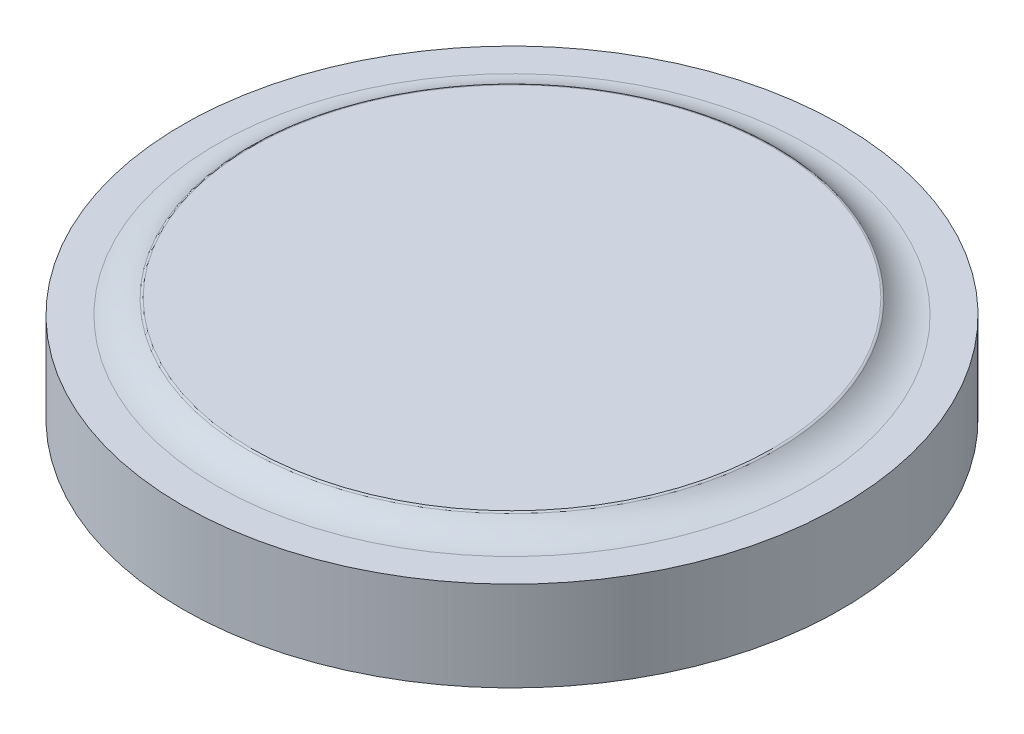
ISO-10303-21;
HEADER;
FILE_DESCRIPTION(('STEP AP214'),'2;1');
FILE_NAME('part.step','',(''),(''),'','','');
FILE_SCHEMA(('AUTOMOTIVE_DESIGN { 1 0 10303 214 1 1 1 1 }'));
ENDSEC;
DATA;
#1=APPLICATION_CONTEXT('core data for automotive mechanical design processes');
#2=APPLICATION_PROTOCOL_DEFINITION('international standard','automotive_design',2000,#1);
#3=PRODUCT_CONTEXT('',#1,'mechanical');
#4=PRODUCT('Part','Part','',(#3));
#5=PRODUCT_RELATED_PRODUCT_CATEGORY('part','',(#4));
#6=PRODUCT_DEFINITION_FORMATION('','',#4);
#7=PRODUCT_DEFINITION_CONTEXT('part definition',#1,'design');
#8=PRODUCT_DEFINITION('design','',#6,#7);
#9=PRODUCT_DEFINITION_SHAPE('','',#8);
#10=(LENGTH_UNIT() NAMED_UNIT(*) SI_UNIT(.MILLI.,.METRE.));
#11=(NAMED_UNIT(*) PLANE_ANGLE_UNIT() SI_UNIT($,.RADIAN.));
#12=(NAMED_UNIT(*) SI_UNIT($,.STERADIAN.) SOLID_ANGLE_UNIT());
#13=UNCERTAINTY_MEASURE_WITH_UNIT(LENGTH_MEASURE(1.E-05),#10,'distance_accuracy_value','');
#14=(GEOMETRIC_REPRESENTATION_CONTEXT(3) GLOBAL_UNCERTAINTY_ASSIGNED_CONTEXT((#13)) GLOBAL_UNIT_ASSIGNED_CONTEXT((#10,
#11,#12)) REPRESENTATION_CONTEXT('',''));
#15=CARTESIAN_POINT('',(0.,0.,0.));
#16=DIRECTION('',(0.,0.,1.));
#17=DIRECTION('',(1.,0.,0.));
#18=AXIS2_PLACEMENT_3D('',#15,#16,#17);
#19=CARTESIAN_POINT('',(0.,3.,0.));
#20=DIRECTION('',(0.,-1.,0.));
#21=DIRECTION('',(0.,0.,-1.));
#22=AXIS2_PLACEMENT_3D('',#19,#20,#21);
#23=CYLINDRICAL_SURFACE('',#22,11.);
#24=CARTESIAN_POINT('',(0.,3.,0.));
#25=DIRECTION('',(0.,1.,0.));
#26=DIRECTION('',(0.,0.,1.));
#27=AXIS2_PLACEMENT_3D('',#24,#25,#26);
#28=CIRCLE('',#27,11.);
#29=CARTESIAN_POINT('',(0.,3.,11.));
#30=VERTEX_POINT('',#29);
#31=EDGE_CURVE('E51',#30,#30,#28,.T.);
#32=ORIENTED_EDGE('',*,*,#31,.F.);
#33=EDGE_LOOP('',(#32));
#34=FACE_BOUND('',#33,.T.);
#35=CARTESIAN_POINT('',(0.,0.,0.));
#36=DIRECTION('',(0.,1.,0.));
#37=DIRECTION('',(0.,0.,1.));
#38=AXIS2_PLACEMENT_3D('',#35,#36,#37);
#39=CIRCLE('',#38,11.);
#40=CARTESIAN_POINT('',(0.,0.,11.));
#41=VERTEX_POINT('',#40);
#42=EDGE_CURVE('E54',#41,#41,#39,.T.);
#43=ORIENTED_EDGE('',*,*,#42,.T.);
#44=EDGE_LOOP('',(#43));
#45=FACE_BOUND('',#44,.T.);
#46=ADVANCED_FACE('F36',(#34,#45),#23,.T.);
#47=CARTESIAN_POINT('',(0.,3.,0.));
#48=DIRECTION('',(0.,1.,0.));
#49=DIRECTION('',(0.,0.,1.));
#50=AXIS2_PLACEMENT_3D('',#47,#48,#49);
#51=PLANE('',#50);
#52=CARTESIAN_POINT('',(0.,3.,0.));
#53=DIRECTION('',(0.,1.,0.));
#54=DIRECTION('',(0.,0.,1.));
#55=AXIS2_PLACEMENT_3D('',#52,#53,#54);
#56=CIRCLE('',#55,9.8680339887499);
#57=CARTESIAN_POINT('',(0.,3.,9.8680339887499));
#58=VERTEX_POINT('',#57);
#59=EDGE_CURVE('E47',#58,#58,#56,.F.);
#60=ORIENTED_EDGE('',*,*,#59,.T.);
#61=EDGE_LOOP('',(#60));
#62=FACE_BOUND('',#61,.T.);
#63=ORIENTED_EDGE('',*,*,#31,.T.);
#64=EDGE_LOOP('',(#63));
#65=FACE_BOUND('',#64,.T.);
#66=ADVANCED_FACE('F60',(#62,#65),#51,.T.);
#67=CARTESIAN_POINT('',(0.,0.,0.));
#68=DIRECTION('',(0.,1.,0.));
#69=DIRECTION('',(0.,0.,1.));
#70=AXIS2_PLACEMENT_3D('',#67,#68,#69);
#71=PLANE('',#70);
#72=ORIENTED_EDGE('',*,*,#42,.F.);
#73=EDGE_LOOP('',(#72));
#74=FACE_BOUND('',#73,.T.);
#75=ADVANCED_FACE('F67',(#74),#71,.F.);
#76=CARTESIAN_POINT('',(0.,3.5,0.));
#77=DIRECTION('',(0.,1.,0.));
#78=DIRECTION('',(0.,0.,1.));
#79=AXIS2_PLACEMENT_3D('',#76,#77,#78);
#80=PLANE('',#79);
#81=CARTESIAN_POINT('',(0.,3.5,0.));
#82=DIRECTION('',(0.,1.,0.));
#83=DIRECTION('',(0.,0.,1.));
#84=AXIS2_PLACEMENT_3D('',#81,#82,#83);
#85=CIRCLE('',#84,8.70613898488767);
#86=CARTESIAN_POINT('',(0.,3.5,8.70613898488767));
#87=VERTEX_POINT('',#86);
#88=EDGE_CURVE('E43',#87,#87,#85,.T.);
#89=ORIENTED_EDGE('',*,*,#88,.T.);
#90=EDGE_LOOP('',(#89));
#91=FACE_BOUND('',#90,.T.);
#92=ADVANCED_FACE('F69',(#91),#80,.T.);
#93=CARTESIAN_POINT('',(0.,4.5,0.));
#94=DIRECTION('',(0.,1.,0.));
#95=DIRECTION('',(0.,0.,1.));
#96=AXIS2_PLACEMENT_3D('',#93,#94,#95);
#97=TOROIDAL_SURFACE('',#96,9.8680339887499,1.5);
#98=CARTESIAN_POINT('',(0.,3.46875,0.));
#99=DIRECTION('',(0.,1.,0.));
#100=DIRECTION('',(0.,0.,1.));
#101=AXIS2_PLACEMENT_3D('',#98,#99,#100);
#102=CIRCLE('',#101,8.77875742262906);
#103=CARTESIAN_POINT('',(0.,3.46875,8.77875742262906));
#104=VERTEX_POINT('',#103);
#105=EDGE_CURVE('E11',#104,#104,#102,.F.);
#106=ORIENTED_EDGE('',*,*,#105,.T.);
#107=EDGE_LOOP('',(#106));
#108=FACE_BOUND('',#107,.T.);
#109=ORIENTED_EDGE('',*,*,#59,.F.);
#110=EDGE_LOOP('',(#109));
#111=FACE_BOUND('',#110,.T.);
#112=ADVANCED_FACE('F75',(#108,#111),#97,.F.);
#113=CARTESIAN_POINT('',(0.,3.4,0.));
#114=DIRECTION('',(0.,-1.,0.));
#115=DIRECTION('',(0.,0.,-1.));
#116=AXIS2_PLACEMENT_3D('',#113,#114,#115);
#117=TOROIDAL_SURFACE('',#116,8.70613898488767,0.1);
#118=ORIENTED_EDGE('',*,*,#105,.F.);
#119=EDGE_LOOP('',(#118));
#120=FACE_BOUND('',#119,.T.);
#121=ORIENTED_EDGE('',*,*,#88,.F.);
#122=EDGE_LOOP('',(#121));
#123=FACE_BOUND('',#122,.T.);
#124=ADVANCED_FACE('F38',(#120,#123),#117,.T.);
#125=CLOSED_SHELL('',(#46,#66,#75,#92,#112,#124));
#126=MANIFOLD_SOLID_BREP('B2',#125);
#127=ADVANCED_BREP_SHAPE_REPRESENTATION('',(#18,#126),#14);
#128=SHAPE_DEFINITION_REPRESENTATION(#9,#127);
ENDSEC;
END-ISO-10303-21;
